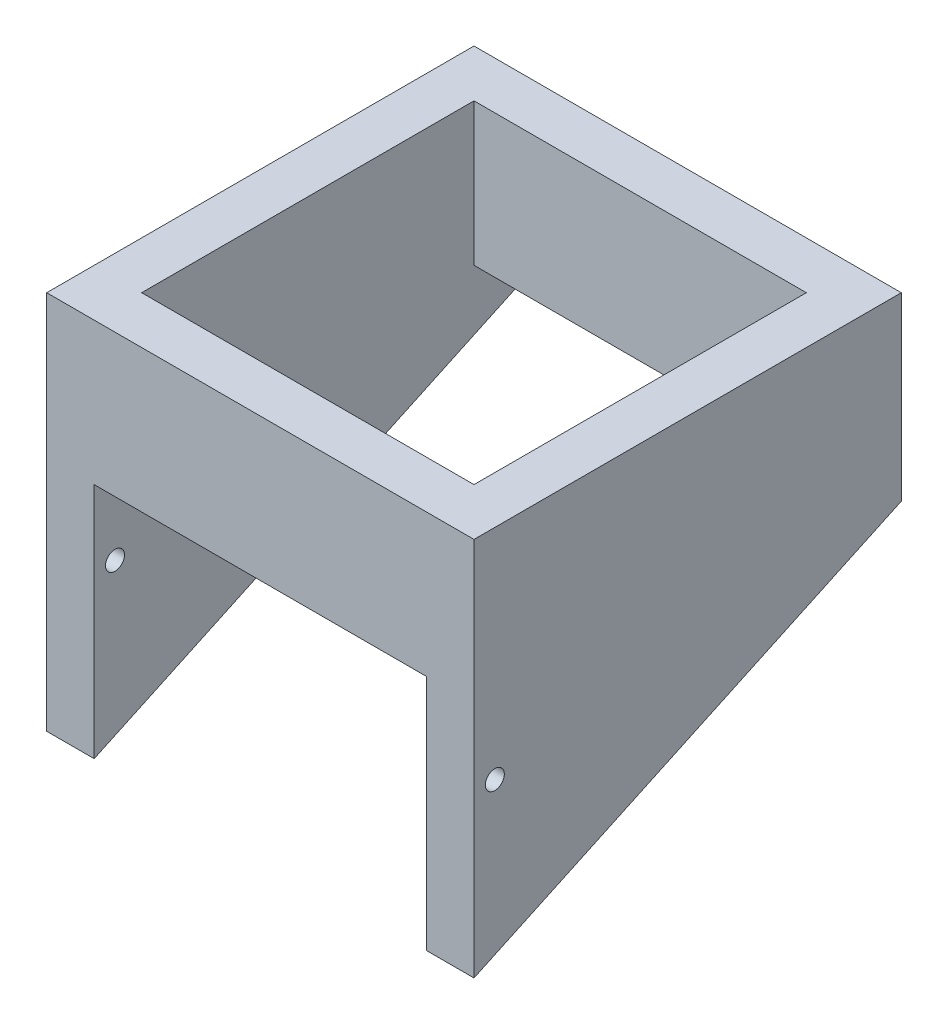
ISO-10303-21;
HEADER;
FILE_DESCRIPTION(('STEP AP214'),'2;1');
FILE_NAME('part.step','',(''),(''),'','','');
FILE_SCHEMA(('AUTOMOTIVE_DESIGN { 1 0 10303 214 1 1 1 1 }'));
ENDSEC;
DATA;
#1=APPLICATION_CONTEXT('core data for automotive mechanical design processes');
#2=APPLICATION_PROTOCOL_DEFINITION('international standard','automotive_design',2000,#1);
#3=PRODUCT_CONTEXT('',#1,'mechanical');
#4=PRODUCT('Part','Part','',(#3));
#5=PRODUCT_RELATED_PRODUCT_CATEGORY('part','',(#4));
#6=PRODUCT_DEFINITION_FORMATION('','',#4);
#7=PRODUCT_DEFINITION_CONTEXT('part definition',#1,'design');
#8=PRODUCT_DEFINITION('design','',#6,#7);
#9=PRODUCT_DEFINITION_SHAPE('','',#8);
#10=(LENGTH_UNIT() NAMED_UNIT(*) SI_UNIT(.MILLI.,.METRE.));
#11=(NAMED_UNIT(*) PLANE_ANGLE_UNIT() SI_UNIT($,.RADIAN.));
#12=(NAMED_UNIT(*) SI_UNIT($,.STERADIAN.) SOLID_ANGLE_UNIT());
#13=UNCERTAINTY_MEASURE_WITH_UNIT(LENGTH_MEASURE(1.E-05),#10,'distance_accuracy_value','');
#14=(GEOMETRIC_REPRESENTATION_CONTEXT(3) GLOBAL_UNCERTAINTY_ASSIGNED_CONTEXT((#13)) GLOBAL_UNIT_ASSIGNED_CONTEXT((#10,
#11,#12)) REPRESENTATION_CONTEXT('',''));
#15=CARTESIAN_POINT('',(0.,0.,0.));
#16=DIRECTION('',(0.,0.,1.));
#17=DIRECTION('',(1.,0.,0.));
#18=AXIS2_PLACEMENT_3D('',#15,#16,#17);
#19=CARTESIAN_POINT('',(-22.5,20.,-22.5));
#20=DIRECTION('',(0.,0.,1.));
#21=DIRECTION('',(1.,0.,0.));
#22=AXIS2_PLACEMENT_3D('',#19,#20,#21);
#23=PLANE('',#22);
#24=DIRECTION('',(0.,1.,0.));
#25=VECTOR('',#24,1.);
#26=CARTESIAN_POINT('',(-17.5,-20.,-22.5));
#27=LINE('',#26,#25);
#28=CARTESIAN_POINT('',(-17.5,0.983844616974601,-22.5));
#29=VERTEX_POINT('',#28);
#30=CARTESIAN_POINT('',(-17.5,5.,-22.5));
#31=VERTEX_POINT('',#30);
#32=EDGE_CURVE('E134',#29,#31,#27,.T.);
#33=ORIENTED_EDGE('',*,*,#32,.F.);
#34=DIRECTION('',(1.,0.,0.));
#35=VECTOR('',#34,1.);
#36=CARTESIAN_POINT('',(-22.5,0.983844616974594,-22.5));
#37=LINE('',#36,#35);
#38=CARTESIAN_POINT('',(-22.5,0.983844616974594,-22.5));
#39=VERTEX_POINT('',#38);
#40=EDGE_CURVE('E194',#39,#29,#37,.T.);
#41=ORIENTED_EDGE('',*,*,#40,.F.);
#42=DIRECTION('',(0.,-1.,0.));
#43=VECTOR('',#42,1.);
#44=CARTESIAN_POINT('',(-22.5,20.,-22.5));
#45=LINE('',#44,#43);
#46=CARTESIAN_POINT('',(-22.5,20.,-22.5));
#47=VERTEX_POINT('',#46);
#48=EDGE_CURVE('E252',#47,#39,#45,.T.);
#49=ORIENTED_EDGE('',*,*,#48,.F.);
#50=DIRECTION('',(-1.,0.,0.));
#51=VECTOR('',#50,1.);
#52=CARTESIAN_POINT('',(-22.5,20.,-22.5));
#53=LINE('',#52,#51);
#54=CARTESIAN_POINT('',(22.5,20.,-22.5));
#55=VERTEX_POINT('',#54);
#56=EDGE_CURVE('E231',#55,#47,#53,.T.);
#57=ORIENTED_EDGE('',*,*,#56,.F.);
#58=DIRECTION('',(0.,-1.,0.));
#59=VECTOR('',#58,1.);
#60=CARTESIAN_POINT('',(22.5,20.,-22.5));
#61=LINE('',#60,#59);
#62=CARTESIAN_POINT('',(22.5,0.983844616974594,-22.5));
#63=VERTEX_POINT('',#62);
#64=EDGE_CURVE('E53',#55,#63,#61,.T.);
#65=ORIENTED_EDGE('',*,*,#64,.T.);
#66=CARTESIAN_POINT('',(17.5,0.983844616974594,-22.5));
#67=VERTEX_POINT('',#66);
#68=EDGE_CURVE('E190',#67,#63,#37,.T.);
#69=ORIENTED_EDGE('',*,*,#68,.F.);
#70=DIRECTION('',(0.,1.,0.));
#71=VECTOR('',#70,1.);
#72=CARTESIAN_POINT('',(17.5,-20.,-22.5));
#73=LINE('',#72,#71);
#74=CARTESIAN_POINT('',(17.5,5.,-22.5));
#75=VERTEX_POINT('',#74);
#76=EDGE_CURVE('E160',#67,#75,#73,.T.);
#77=ORIENTED_EDGE('',*,*,#76,.T.);
#78=DIRECTION('',(1.,0.,0.));
#79=VECTOR('',#78,1.);
#80=CARTESIAN_POINT('',(-17.5,5.,-22.5));
#81=LINE('',#80,#79);
#82=EDGE_CURVE('E147',#31,#75,#81,.T.);
#83=ORIENTED_EDGE('',*,*,#82,.F.);
#84=EDGE_LOOP('',(#33,#41,#49,#57,#65,#69,#77,#83));
#85=FACE_BOUND('',#84,.T.);
#86=ADVANCED_FACE('F43',(#85),#23,.F.);
#87=CARTESIAN_POINT('',(-22.5,20.,22.5));
#88=DIRECTION('',(0.,0.,-1.));
#89=DIRECTION('',(-1.,0.,0.));
#90=AXIS2_PLACEMENT_3D('',#87,#88,#89);
#91=PLANE('',#90);
#92=DIRECTION('',(0.,1.,0.));
#93=VECTOR('',#92,1.);
#94=CARTESIAN_POINT('',(-17.5,-20.,22.5));
#95=LINE('',#94,#93);
#96=CARTESIAN_POINT('',(-17.5,-20.,22.5));
#97=VERTEX_POINT('',#96);
#98=CARTESIAN_POINT('',(-17.5,5.,22.5));
#99=VERTEX_POINT('',#98);
#100=EDGE_CURVE('E168',#97,#99,#95,.T.);
#101=ORIENTED_EDGE('',*,*,#100,.T.);
#102=DIRECTION('',(1.,0.,0.));
#103=VECTOR('',#102,1.);
#104=CARTESIAN_POINT('',(-17.5,5.,22.5));
#105=LINE('',#104,#103);
#106=CARTESIAN_POINT('',(17.5,5.,22.5));
#107=VERTEX_POINT('',#106);
#108=EDGE_CURVE('E172',#99,#107,#105,.T.);
#109=ORIENTED_EDGE('',*,*,#108,.T.);
#110=DIRECTION('',(0.,1.,0.));
#111=VECTOR('',#110,1.);
#112=CARTESIAN_POINT('',(17.5,-20.,22.5));
#113=LINE('',#112,#111);
#114=CARTESIAN_POINT('',(17.5,-20.,22.5));
#115=VERTEX_POINT('',#114);
#116=EDGE_CURVE('E148',#115,#107,#113,.T.);
#117=ORIENTED_EDGE('',*,*,#116,.F.);
#118=DIRECTION('',(1.,0.,0.));
#119=VECTOR('',#118,1.);
#120=CARTESIAN_POINT('',(-22.5,-20.,22.5));
#121=LINE('',#120,#119);
#122=CARTESIAN_POINT('',(22.5,-20.,22.5));
#123=VERTEX_POINT('',#122);
#124=EDGE_CURVE('E226',#115,#123,#121,.T.);
#125=ORIENTED_EDGE('',*,*,#124,.T.);
#126=DIRECTION('',(0.,-1.,0.));
#127=VECTOR('',#126,1.);
#128=CARTESIAN_POINT('',(22.5,20.,22.5));
#129=LINE('',#128,#127);
#130=CARTESIAN_POINT('',(22.5,20.,22.5));
#131=VERTEX_POINT('',#130);
#132=EDGE_CURVE('E241',#131,#123,#129,.T.);
#133=ORIENTED_EDGE('',*,*,#132,.F.);
#134=DIRECTION('',(1.,0.,0.));
#135=VECTOR('',#134,1.);
#136=CARTESIAN_POINT('',(-22.5,20.,22.5));
#137=LINE('',#136,#135);
#138=CARTESIAN_POINT('',(-22.5,20.,22.5));
#139=VERTEX_POINT('',#138);
#140=EDGE_CURVE('E238',#139,#131,#137,.T.);
#141=ORIENTED_EDGE('',*,*,#140,.F.);
#142=DIRECTION('',(0.,-1.,0.));
#143=VECTOR('',#142,1.);
#144=CARTESIAN_POINT('',(-22.5,20.,22.5));
#145=LINE('',#144,#143);
#146=CARTESIAN_POINT('',(-22.5,-20.,22.5));
#147=VERTEX_POINT('',#146);
#148=EDGE_CURVE('E248',#139,#147,#145,.T.);
#149=ORIENTED_EDGE('',*,*,#148,.T.);
#150=EDGE_CURVE('E232',#147,#97,#121,.T.);
#151=ORIENTED_EDGE('',*,*,#150,.T.);
#152=EDGE_LOOP('',(#101,#109,#117,#125,#133,#141,#149,#151));
#153=FACE_BOUND('',#152,.T.);
#154=ADVANCED_FACE('F277',(#153),#91,.F.);
#155=CARTESIAN_POINT('',(-17.5,20.,-17.5));
#156=DIRECTION('',(0.,0.,1.));
#157=DIRECTION('',(1.,0.,0.));
#158=AXIS2_PLACEMENT_3D('',#155,#156,#157);
#159=PLANE('',#158);
#160=DIRECTION('',(0.,-1.,0.));
#161=VECTOR('',#160,1.);
#162=CARTESIAN_POINT('',(-17.5,20.,-17.5));
#163=LINE('',#162,#161);
#164=CARTESIAN_POINT('',(-17.5,20.,-17.5));
#165=VERTEX_POINT('',#164);
#166=CARTESIAN_POINT('',(-17.5,5.,-17.5));
#167=VERTEX_POINT('',#166);
#168=EDGE_CURVE('E219',#165,#167,#163,.T.);
#169=ORIENTED_EDGE('',*,*,#168,.T.);
#170=DIRECTION('',(1.,0.,0.));
#171=VECTOR('',#170,1.);
#172=CARTESIAN_POINT('',(-17.5,5.,-17.5));
#173=LINE('',#172,#171);
#174=CARTESIAN_POINT('',(17.5,5.,-17.5));
#175=VERTEX_POINT('',#174);
#176=EDGE_CURVE('E154',#167,#175,#173,.T.);
#177=ORIENTED_EDGE('',*,*,#176,.T.);
#178=DIRECTION('',(0.,-1.,0.));
#179=VECTOR('',#178,1.);
#180=CARTESIAN_POINT('',(17.5,20.,-17.5));
#181=LINE('',#180,#179);
#182=CARTESIAN_POINT('',(17.5,20.,-17.5));
#183=VERTEX_POINT('',#182);
#184=EDGE_CURVE('E222',#183,#175,#181,.T.);
#185=ORIENTED_EDGE('',*,*,#184,.F.);
#186=DIRECTION('',(-1.,0.,0.));
#187=VECTOR('',#186,1.);
#188=CARTESIAN_POINT('',(-17.5,20.,-17.5));
#189=LINE('',#188,#187);
#190=EDGE_CURVE('E204',#183,#165,#189,.T.);
#191=ORIENTED_EDGE('',*,*,#190,.T.);
#192=EDGE_LOOP('',(#169,#177,#185,#191));
#193=FACE_BOUND('',#192,.T.);
#194=ADVANCED_FACE('F287',(#193),#159,.T.);
#195=CARTESIAN_POINT('',(-17.5,20.,17.5));
#196=DIRECTION('',(0.,0.,-1.));
#197=DIRECTION('',(-1.,0.,0.));
#198=AXIS2_PLACEMENT_3D('',#195,#196,#197);
#199=PLANE('',#198);
#200=DIRECTION('',(0.,-1.,0.));
#201=VECTOR('',#200,1.);
#202=CARTESIAN_POINT('',(17.5,20.,17.5));
#203=LINE('',#202,#201);
#204=CARTESIAN_POINT('',(17.5,20.,17.5));
#205=VERTEX_POINT('',#204);
#206=CARTESIAN_POINT('',(17.5,5.,17.5));
#207=VERTEX_POINT('',#206);
#208=EDGE_CURVE('E213',#205,#207,#203,.T.);
#209=ORIENTED_EDGE('',*,*,#208,.T.);
#210=DIRECTION('',(-1.,0.,0.));
#211=VECTOR('',#210,1.);
#212=CARTESIAN_POINT('',(-17.5,5.,17.5));
#213=LINE('',#212,#211);
#214=CARTESIAN_POINT('',(-17.5,5.,17.5));
#215=VERTEX_POINT('',#214);
#216=EDGE_CURVE('E11',#207,#215,#213,.T.);
#217=ORIENTED_EDGE('',*,*,#216,.T.);
#218=DIRECTION('',(0.,-1.,0.));
#219=VECTOR('',#218,1.);
#220=CARTESIAN_POINT('',(-17.5,20.,17.5));
#221=LINE('',#220,#219);
#222=CARTESIAN_POINT('',(-17.5,20.,17.5));
#223=VERTEX_POINT('',#222);
#224=EDGE_CURVE('E67',#223,#215,#221,.T.);
#225=ORIENTED_EDGE('',*,*,#224,.F.);
#226=DIRECTION('',(1.,0.,0.));
#227=VECTOR('',#226,1.);
#228=CARTESIAN_POINT('',(-17.5,20.,17.5));
#229=LINE('',#228,#227);
#230=EDGE_CURVE('E210',#223,#205,#229,.T.);
#231=ORIENTED_EDGE('',*,*,#230,.T.);
#232=EDGE_LOOP('',(#209,#217,#225,#231));
#233=FACE_BOUND('',#232,.T.);
#234=ADVANCED_FACE('F278',(#233),#199,.T.);
#235=CARTESIAN_POINT('',(-22.5,0.983844616974594,-22.5));
#236=DIRECTION('',(0.,0.906307787036652,0.422618261740694));
#237=DIRECTION('',(0.,-0.422618261740694,0.906307787036652));
#238=AXIS2_PLACEMENT_3D('',#235,#236,#237);
#239=PLANE('',#238);
#240=DIRECTION('',(0.,-0.422618261740694,0.906307787036652));
#241=VECTOR('',#240,1.);
#242=CARTESIAN_POINT('',(-17.5,-10.9406410859335,3.07214211340422));
#243=LINE('',#242,#241);
#244=EDGE_CURVE('E141',#29,#97,#243,.T.);
#245=ORIENTED_EDGE('',*,*,#244,.T.);
#246=ORIENTED_EDGE('',*,*,#150,.F.);
#247=DIRECTION('',(0.,-0.422618261740694,0.906307787036652));
#248=VECTOR('',#247,1.);
#249=CARTESIAN_POINT('',(-22.5,0.983844616974594,-22.5));
#250=LINE('',#249,#248);
#251=EDGE_CURVE('E186',#39,#147,#250,.T.);
#252=ORIENTED_EDGE('',*,*,#251,.F.);
#253=ORIENTED_EDGE('',*,*,#40,.T.);
#254=EDGE_LOOP('',(#245,#246,#252,#253));
#255=FACE_BOUND('',#254,.T.);
#256=ADVANCED_FACE('F294',(#255),#239,.F.);
#257=CARTESIAN_POINT('',(0.,20.,0.));
#258=DIRECTION('',(0.,-1.,0.));
#259=DIRECTION('',(0.,0.,-1.));
#260=AXIS2_PLACEMENT_3D('',#257,#258,#259);
#261=PLANE('',#260);
#262=DIRECTION('',(0.,0.,-1.));
#263=VECTOR('',#262,1.);
#264=CARTESIAN_POINT('',(22.5,20.,22.5));
#265=LINE('',#264,#263);
#266=EDGE_CURVE('E227',#131,#55,#265,.T.);
#267=ORIENTED_EDGE('',*,*,#266,.T.);
#268=ORIENTED_EDGE('',*,*,#56,.T.);
#269=DIRECTION('',(0.,0.,1.));
#270=VECTOR('',#269,1.);
#271=CARTESIAN_POINT('',(-22.5,20.,22.5));
#272=LINE('',#271,#270);
#273=EDGE_CURVE('E235',#47,#139,#272,.T.);
#274=ORIENTED_EDGE('',*,*,#273,.T.);
#275=ORIENTED_EDGE('',*,*,#140,.T.);
#276=EDGE_LOOP('',(#267,#268,#274,#275));
#277=FACE_BOUND('',#276,.T.);
#278=DIRECTION('',(0.,0.,-1.));
#279=VECTOR('',#278,1.);
#280=CARTESIAN_POINT('',(17.5,20.,17.5));
#281=LINE('',#280,#279);
#282=EDGE_CURVE('E201',#205,#183,#281,.T.);
#283=ORIENTED_EDGE('',*,*,#282,.F.);
#284=ORIENTED_EDGE('',*,*,#230,.F.);
#285=DIRECTION('',(0.,0.,1.));
#286=VECTOR('',#285,1.);
#287=CARTESIAN_POINT('',(-17.5,20.,17.5));
#288=LINE('',#287,#286);
#289=EDGE_CURVE('E207',#165,#223,#288,.T.);
#290=ORIENTED_EDGE('',*,*,#289,.F.);
#291=ORIENTED_EDGE('',*,*,#190,.F.);
#292=EDGE_LOOP('',(#283,#284,#290,#291));
#293=FACE_BOUND('',#292,.T.);
#294=ADVANCED_FACE('F284',(#277,#293),#261,.F.);
#295=CARTESIAN_POINT('',(22.5,20.,22.5));
#296=DIRECTION('',(-1.,0.,0.));
#297=DIRECTION('',(0.,0.,1.));
#298=AXIS2_PLACEMENT_3D('',#295,#296,#297);
#299=PLANE('',#298);
#300=CARTESIAN_POINT('',(22.5,-3.,20.30758497053));
#301=DIRECTION('',(1.,0.,0.));
#302=DIRECTION('',(0.,0.,-1.));
#303=AXIS2_PLACEMENT_3D('',#300,#301,#302);
#304=CIRCLE('',#303,1.);
#305=CARTESIAN_POINT('',(22.5,-3.,19.30758497053));
#306=VERTEX_POINT('',#305);
#307=EDGE_CURVE('E323',#306,#306,#304,.T.);
#308=ORIENTED_EDGE('',*,*,#307,.F.);
#309=EDGE_LOOP('',(#308));
#310=FACE_BOUND('',#309,.T.);
#311=ORIENTED_EDGE('',*,*,#132,.T.);
#312=DIRECTION('',(0.,-0.422618261740694,0.906307787036652));
#313=VECTOR('',#312,1.);
#314=CARTESIAN_POINT('',(22.5,0.983844616974594,-22.5));
#315=LINE('',#314,#313);
#316=EDGE_CURVE('E185',#63,#123,#315,.T.);
#317=ORIENTED_EDGE('',*,*,#316,.F.);
#318=ORIENTED_EDGE('',*,*,#64,.F.);
#319=ORIENTED_EDGE('',*,*,#266,.F.);
#320=EDGE_LOOP('',(#311,#317,#318,#319));
#321=FACE_BOUND('',#320,.T.);
#322=ADVANCED_FACE('F45',(#310,#321),#299,.F.);
#323=CARTESIAN_POINT('',(-22.5,20.,22.5));
#324=DIRECTION('',(1.,0.,0.));
#325=DIRECTION('',(0.,0.,-1.));
#326=AXIS2_PLACEMENT_3D('',#323,#324,#325);
#327=PLANE('',#326);
#328=CARTESIAN_POINT('',(-22.5,-3.,20.30758497053));
#329=DIRECTION('',(1.,0.,0.));
#330=DIRECTION('',(0.,0.,-1.));
#331=AXIS2_PLACEMENT_3D('',#328,#329,#330);
#332=CIRCLE('',#331,1.);
#333=CARTESIAN_POINT('',(-22.5,-3.,19.30758497053));
#334=VERTEX_POINT('',#333);
#335=EDGE_CURVE('E321',#334,#334,#332,.T.);
#336=ORIENTED_EDGE('',*,*,#335,.T.);
#337=EDGE_LOOP('',(#336));
#338=FACE_BOUND('',#337,.T.);
#339=ORIENTED_EDGE('',*,*,#48,.T.);
#340=ORIENTED_EDGE('',*,*,#251,.T.);
#341=ORIENTED_EDGE('',*,*,#148,.F.);
#342=ORIENTED_EDGE('',*,*,#273,.F.);
#343=EDGE_LOOP('',(#339,#340,#341,#342));
#344=FACE_BOUND('',#343,.T.);
#345=ADVANCED_FACE('F303',(#338,#344),#327,.F.);
#346=CARTESIAN_POINT('',(17.5,20.,17.5));
#347=DIRECTION('',(-1.,0.,0.));
#348=DIRECTION('',(0.,0.,1.));
#349=AXIS2_PLACEMENT_3D('',#346,#347,#348);
#350=PLANE('',#349);
#351=CARTESIAN_POINT('',(17.5,-3.,20.30758497053));
#352=DIRECTION('',(-1.,0.,0.));
#353=DIRECTION('',(0.,0.,1.));
#354=AXIS2_PLACEMENT_3D('',#351,#352,#353);
#355=CIRCLE('',#354,1.);
#356=CARTESIAN_POINT('',(17.5,-3.,21.30758497053));
#357=VERTEX_POINT('',#356);
#358=EDGE_CURVE('E173',#357,#357,#355,.T.);
#359=ORIENTED_EDGE('',*,*,#358,.F.);
#360=EDGE_LOOP('',(#359));
#361=FACE_BOUND('',#360,.T.);
#362=DIRECTION('',(0.,0.,1.));
#363=VECTOR('',#362,1.);
#364=CARTESIAN_POINT('',(17.5,5.,-22.5));
#365=LINE('',#364,#363);
#366=EDGE_CURVE('E164',#207,#107,#365,.T.);
#367=ORIENTED_EDGE('',*,*,#366,.F.);
#368=ORIENTED_EDGE('',*,*,#208,.F.);
#369=ORIENTED_EDGE('',*,*,#282,.T.);
#370=ORIENTED_EDGE('',*,*,#184,.T.);
#371=EDGE_CURVE('E180',#75,#175,#365,.T.);
#372=ORIENTED_EDGE('',*,*,#371,.F.);
#373=ORIENTED_EDGE('',*,*,#76,.F.);
#374=DIRECTION('',(0.,0.422618261740694,-0.906307787036652));
#375=VECTOR('',#374,1.);
#376=CARTESIAN_POINT('',(17.5,-10.9406410859335,3.07214211340422));
#377=LINE('',#376,#375);
#378=EDGE_CURVE('E60',#115,#67,#377,.T.);
#379=ORIENTED_EDGE('',*,*,#378,.F.);
#380=ORIENTED_EDGE('',*,*,#116,.T.);
#381=EDGE_LOOP('',(#367,#368,#369,#370,#372,#373,#379,#380));
#382=FACE_BOUND('',#381,.T.);
#383=ADVANCED_FACE('F275',(#361,#382),#350,.T.);
#384=CARTESIAN_POINT('',(-17.5,20.,17.5));
#385=DIRECTION('',(1.,0.,0.));
#386=DIRECTION('',(0.,0.,-1.));
#387=AXIS2_PLACEMENT_3D('',#384,#385,#386);
#388=PLANE('',#387);
#389=CARTESIAN_POINT('',(-17.5,-3.,20.30758497053));
#390=DIRECTION('',(1.,0.,0.));
#391=DIRECTION('',(0.,0.,-1.));
#392=AXIS2_PLACEMENT_3D('',#389,#390,#391);
#393=CIRCLE('',#392,1.);
#394=CARTESIAN_POINT('',(-17.5,-3.,19.30758497053));
#395=VERTEX_POINT('',#394);
#396=EDGE_CURVE('E47',#395,#395,#393,.T.);
#397=ORIENTED_EDGE('',*,*,#396,.F.);
#398=EDGE_LOOP('',(#397));
#399=FACE_BOUND('',#398,.T.);
#400=ORIENTED_EDGE('',*,*,#244,.F.);
#401=ORIENTED_EDGE('',*,*,#32,.T.);
#402=DIRECTION('',(0.,0.,1.));
#403=VECTOR('',#402,1.);
#404=CARTESIAN_POINT('',(-17.5,5.,-22.5));
#405=LINE('',#404,#403);
#406=EDGE_CURVE('E138',#31,#167,#405,.T.);
#407=ORIENTED_EDGE('',*,*,#406,.T.);
#408=ORIENTED_EDGE('',*,*,#168,.F.);
#409=ORIENTED_EDGE('',*,*,#289,.T.);
#410=ORIENTED_EDGE('',*,*,#224,.T.);
#411=EDGE_CURVE('E156',#215,#99,#405,.T.);
#412=ORIENTED_EDGE('',*,*,#411,.T.);
#413=ORIENTED_EDGE('',*,*,#100,.F.);
#414=EDGE_LOOP('',(#400,#401,#407,#408,#409,#410,#412,#413));
#415=FACE_BOUND('',#414,.T.);
#416=ADVANCED_FACE('F136',(#399,#415),#388,.T.);
#417=ORIENTED_EDGE('',*,*,#124,.F.);
#418=ORIENTED_EDGE('',*,*,#378,.T.);
#419=ORIENTED_EDGE('',*,*,#68,.T.);
#420=ORIENTED_EDGE('',*,*,#316,.T.);
#421=EDGE_LOOP('',(#417,#418,#419,#420));
#422=FACE_BOUND('',#421,.T.);
#423=ADVANCED_FACE('F264',(#422),#239,.F.);
#424=CARTESIAN_POINT('',(-17.5,5.,-22.5));
#425=DIRECTION('',(0.,-1.,0.));
#426=DIRECTION('',(0.,0.,-1.));
#427=AXIS2_PLACEMENT_3D('',#424,#425,#426);
#428=PLANE('',#427);
#429=ORIENTED_EDGE('',*,*,#406,.F.);
#430=ORIENTED_EDGE('',*,*,#82,.T.);
#431=ORIENTED_EDGE('',*,*,#371,.T.);
#432=ORIENTED_EDGE('',*,*,#176,.F.);
#433=EDGE_LOOP('',(#429,#430,#431,#432));
#434=FACE_BOUND('',#433,.T.);
#435=ADVANCED_FACE('F151',(#434),#428,.T.);
#436=ORIENTED_EDGE('',*,*,#366,.T.);
#437=ORIENTED_EDGE('',*,*,#108,.F.);
#438=ORIENTED_EDGE('',*,*,#411,.F.);
#439=ORIENTED_EDGE('',*,*,#216,.F.);
#440=EDGE_LOOP('',(#436,#437,#438,#439));
#441=FACE_BOUND('',#440,.T.);
#442=ADVANCED_FACE('F271',(#441),#428,.T.);
#443=CARTESIAN_POINT('',(-22.5,-3.,20.30758497053));
#444=DIRECTION('',(1.,0.,0.));
#445=DIRECTION('',(0.,0.,-1.));
#446=AXIS2_PLACEMENT_3D('',#443,#444,#445);
#447=CYLINDRICAL_SURFACE('',#446,1.);
#448=ORIENTED_EDGE('',*,*,#396,.T.);
#449=EDGE_LOOP('',(#448));
#450=FACE_BOUND('',#449,.T.);
#451=ORIENTED_EDGE('',*,*,#335,.F.);
#452=EDGE_LOOP('',(#451));
#453=FACE_BOUND('',#452,.T.);
#454=ADVANCED_FACE('F332',(#450,#453),#447,.F.);
#455=ORIENTED_EDGE('',*,*,#358,.T.);
#456=EDGE_LOOP('',(#455));
#457=FACE_BOUND('',#456,.T.);
#458=ORIENTED_EDGE('',*,*,#307,.T.);
#459=EDGE_LOOP('',(#458));
#460=FACE_BOUND('',#459,.T.);
#461=ADVANCED_FACE('F334',(#457,#460),#447,.F.);
#462=CLOSED_SHELL('',(#86,#154,#194,#234,#256,#294,#322,#345,#383,#416,#423,#435,#442,#454,#461));
#463=MANIFOLD_SOLID_BREP('B2',#462);
#464=ADVANCED_BREP_SHAPE_REPRESENTATION('',(#18,#463),#14);
#465=SHAPE_DEFINITION_REPRESENTATION(#9,#464);
ENDSEC;
END-ISO-10303-21;
